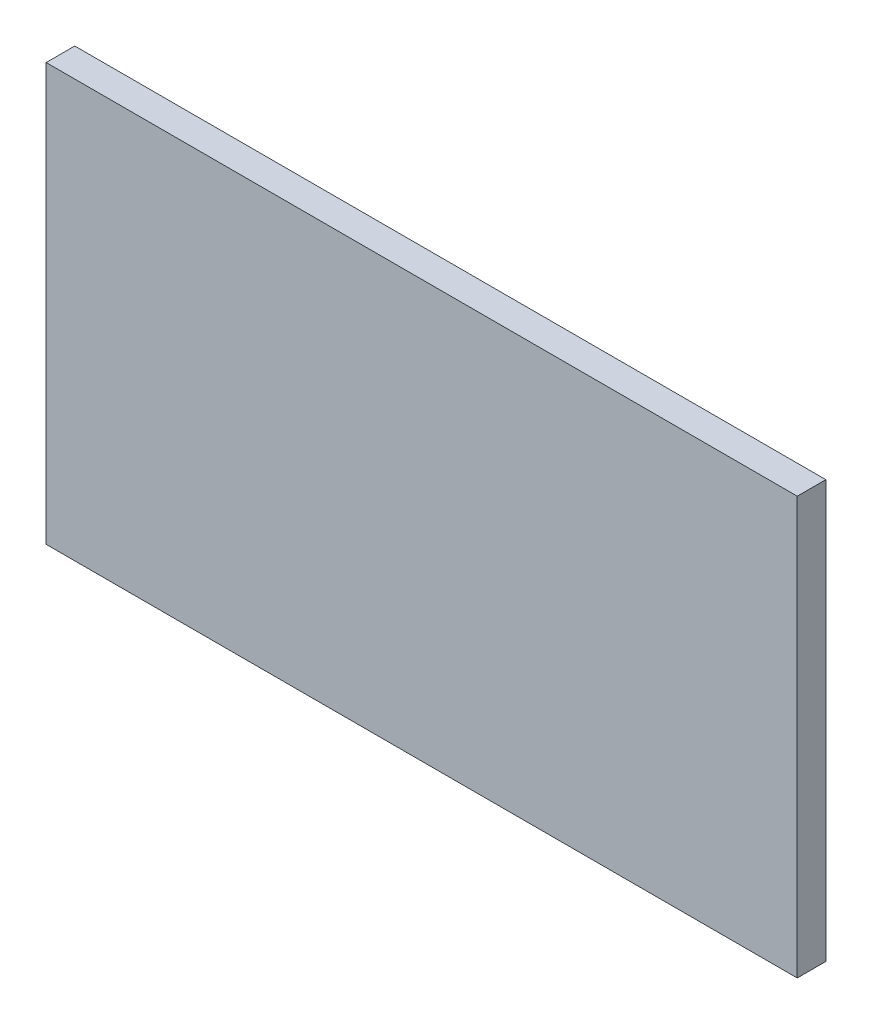
ISO-10303-21;
HEADER;
FILE_DESCRIPTION(('STEP AP214'),'2;1');
FILE_NAME('part.step','',(''),(''),'','','');
FILE_SCHEMA(('AUTOMOTIVE_DESIGN { 1 0 10303 214 1 1 1 1 }'));
ENDSEC;
DATA;
#1=APPLICATION_CONTEXT('core data for automotive mechanical design processes');
#2=APPLICATION_PROTOCOL_DEFINITION('international standard','automotive_design',2000,#1);
#3=PRODUCT_CONTEXT('',#1,'mechanical');
#4=PRODUCT('Part','Part','',(#3));
#5=PRODUCT_RELATED_PRODUCT_CATEGORY('part','',(#4));
#6=PRODUCT_DEFINITION_FORMATION('','',#4);
#7=PRODUCT_DEFINITION_CONTEXT('part definition',#1,'design');
#8=PRODUCT_DEFINITION('design','',#6,#7);
#9=PRODUCT_DEFINITION_SHAPE('','',#8);
#10=(LENGTH_UNIT() NAMED_UNIT(*) SI_UNIT(.MILLI.,.METRE.));
#11=(NAMED_UNIT(*) PLANE_ANGLE_UNIT() SI_UNIT($,.RADIAN.));
#12=(NAMED_UNIT(*) SI_UNIT($,.STERADIAN.) SOLID_ANGLE_UNIT());
#13=UNCERTAINTY_MEASURE_WITH_UNIT(LENGTH_MEASURE(1.E-05),#10,'distance_accuracy_value','');
#14=(GEOMETRIC_REPRESENTATION_CONTEXT(3) GLOBAL_UNCERTAINTY_ASSIGNED_CONTEXT((#13)) GLOBAL_UNIT_ASSIGNED_CONTEXT((#10,
#11,#12)) REPRESENTATION_CONTEXT('',''));
#15=CARTESIAN_POINT('',(0.,0.,0.));
#16=DIRECTION('',(0.,0.,1.));
#17=DIRECTION('',(1.,0.,0.));
#18=AXIS2_PLACEMENT_3D('',#15,#16,#17);
#19=CARTESIAN_POINT('',(12.50008,2.4,0.));
#20=DIRECTION('',(0.,0.,-1.));
#21=DIRECTION('',(-1.,0.,0.));
#22=AXIS2_PLACEMENT_3D('',#19,#20,#21);
#23=PLANE('',#22);
#24=DIRECTION('',(1.,0.,0.));
#25=VECTOR('',#24,1.);
#26=CARTESIAN_POINT('',(12.05008,2.65,0.));
#27=LINE('',#26,#25);
#28=CARTESIAN_POINT('',(12.05008,2.65,0.));
#29=VERTEX_POINT('',#28);
#30=CARTESIAN_POINT('',(12.95008,2.65,0.));
#31=VERTEX_POINT('',#30);
#32=EDGE_CURVE('E55',#29,#31,#27,.T.);
#33=ORIENTED_EDGE('',*,*,#32,.T.);
#34=DIRECTION('',(0.,1.,0.));
#35=VECTOR('',#34,1.);
#36=CARTESIAN_POINT('',(12.95008,2.65,0.));
#37=LINE('',#36,#35);
#38=CARTESIAN_POINT('',(12.95008,2.15,0.));
#39=VERTEX_POINT('',#38);
#40=EDGE_CURVE('E57',#31,#39,#37,.F.);
#41=ORIENTED_EDGE('',*,*,#40,.T.);
#42=DIRECTION('',(1.,0.,0.));
#43=VECTOR('',#42,1.);
#44=CARTESIAN_POINT('',(12.95008,2.15,0.));
#45=LINE('',#44,#43);
#46=CARTESIAN_POINT('',(12.05008,2.15,0.));
#47=VERTEX_POINT('',#46);
#48=EDGE_CURVE('E20',#39,#47,#45,.F.);
#49=ORIENTED_EDGE('',*,*,#48,.T.);
#50=DIRECTION('',(0.,1.,0.));
#51=VECTOR('',#50,1.);
#52=CARTESIAN_POINT('',(12.05008,2.15,0.));
#53=LINE('',#52,#51);
#54=EDGE_CURVE('E80',#47,#29,#53,.T.);
#55=ORIENTED_EDGE('',*,*,#54,.T.);
#56=EDGE_LOOP('',(#33,#41,#49,#55));
#57=FACE_BOUND('',#56,.T.);
#58=ADVANCED_FACE('F17',(#57),#23,.T.);
#59=CARTESIAN_POINT('',(12.95008,2.15,0.));
#60=DIRECTION('',(0.,1.,0.));
#61=DIRECTION('',(0.,0.,1.));
#62=AXIS2_PLACEMENT_3D('',#59,#60,#61);
#63=PLANE('',#62);
#64=DIRECTION('',(0.,0.,-1.));
#65=VECTOR('',#64,1.);
#66=CARTESIAN_POINT('',(12.05008,2.15,0.));
#67=LINE('',#66,#65);
#68=CARTESIAN_POINT('',(12.05008,2.15,0.03429));
#69=VERTEX_POINT('',#68);
#70=EDGE_CURVE('E68',#69,#47,#67,.T.);
#71=ORIENTED_EDGE('',*,*,#70,.T.);
#72=ORIENTED_EDGE('',*,*,#48,.F.);
#73=DIRECTION('',(0.,0.,1.));
#74=VECTOR('',#73,1.);
#75=CARTESIAN_POINT('',(12.95008,2.15,0.));
#76=LINE('',#75,#74);
#77=CARTESIAN_POINT('',(12.95008,2.15,0.03429));
#78=VERTEX_POINT('',#77);
#79=EDGE_CURVE('E63',#39,#78,#76,.T.);
#80=ORIENTED_EDGE('',*,*,#79,.T.);
#81=DIRECTION('',(1.,0.,0.));
#82=VECTOR('',#81,1.);
#83=CARTESIAN_POINT('',(12.50008,2.15,0.03429));
#84=LINE('',#83,#82);
#85=EDGE_CURVE('E83',#69,#78,#84,.T.);
#86=ORIENTED_EDGE('',*,*,#85,.F.);
#87=EDGE_LOOP('',(#71,#72,#80,#86));
#88=FACE_BOUND('',#87,.T.);
#89=ADVANCED_FACE('F65',(#88),#63,.F.);
#90=CARTESIAN_POINT('',(12.95008,2.65,0.));
#91=DIRECTION('',(-1.,0.,0.));
#92=DIRECTION('',(0.,0.,1.));
#93=AXIS2_PLACEMENT_3D('',#90,#91,#92);
#94=PLANE('',#93);
#95=ORIENTED_EDGE('',*,*,#79,.F.);
#96=ORIENTED_EDGE('',*,*,#40,.F.);
#97=DIRECTION('',(0.,0.,-1.));
#98=VECTOR('',#97,1.);
#99=CARTESIAN_POINT('',(12.95008,2.65,0.));
#100=LINE('',#99,#98);
#101=CARTESIAN_POINT('',(12.95008,2.65,0.03429));
#102=VERTEX_POINT('',#101);
#103=EDGE_CURVE('E75',#31,#102,#100,.F.);
#104=ORIENTED_EDGE('',*,*,#103,.T.);
#105=DIRECTION('',(0.,1.,0.));
#106=VECTOR('',#105,1.);
#107=CARTESIAN_POINT('',(12.95008,2.4,0.03429));
#108=LINE('',#107,#106);
#109=EDGE_CURVE('E72',#78,#102,#108,.T.);
#110=ORIENTED_EDGE('',*,*,#109,.F.);
#111=EDGE_LOOP('',(#95,#96,#104,#110));
#112=FACE_BOUND('',#111,.T.);
#113=ADVANCED_FACE('F70',(#112),#94,.F.);
#114=CARTESIAN_POINT('',(12.05008,2.65,0.));
#115=DIRECTION('',(0.,-1.,0.));
#116=DIRECTION('',(0.,0.,-1.));
#117=AXIS2_PLACEMENT_3D('',#114,#115,#116);
#118=PLANE('',#117);
#119=ORIENTED_EDGE('',*,*,#103,.F.);
#120=ORIENTED_EDGE('',*,*,#32,.F.);
#121=DIRECTION('',(0.,0.,-1.));
#122=VECTOR('',#121,1.);
#123=CARTESIAN_POINT('',(12.05008,2.65,0.));
#124=LINE('',#123,#122);
#125=CARTESIAN_POINT('',(12.05008,2.65,0.03429));
#126=VERTEX_POINT('',#125);
#127=EDGE_CURVE('E35',#29,#126,#124,.F.);
#128=ORIENTED_EDGE('',*,*,#127,.T.);
#129=DIRECTION('',(1.,0.,0.));
#130=VECTOR('',#129,1.);
#131=CARTESIAN_POINT('',(12.50008,2.65,0.03429));
#132=LINE('',#131,#130);
#133=EDGE_CURVE('E26',#102,#126,#132,.F.);
#134=ORIENTED_EDGE('',*,*,#133,.F.);
#135=EDGE_LOOP('',(#119,#120,#128,#134));
#136=FACE_BOUND('',#135,.T.);
#137=ADVANCED_FACE('F89',(#136),#118,.F.);
#138=CARTESIAN_POINT('',(12.05008,2.15,0.));
#139=DIRECTION('',(1.,0.,0.));
#140=DIRECTION('',(0.,0.,-1.));
#141=AXIS2_PLACEMENT_3D('',#138,#139,#140);
#142=PLANE('',#141);
#143=ORIENTED_EDGE('',*,*,#127,.F.);
#144=ORIENTED_EDGE('',*,*,#54,.F.);
#145=ORIENTED_EDGE('',*,*,#70,.F.);
#146=DIRECTION('',(0.,1.,0.));
#147=VECTOR('',#146,1.);
#148=CARTESIAN_POINT('',(12.05008,2.4,0.03429));
#149=LINE('',#148,#147);
#150=EDGE_CURVE('E11',#126,#69,#149,.F.);
#151=ORIENTED_EDGE('',*,*,#150,.F.);
#152=EDGE_LOOP('',(#143,#144,#145,#151));
#153=FACE_BOUND('',#152,.T.);
#154=ADVANCED_FACE('F91',(#153),#142,.F.);
#155=CARTESIAN_POINT('',(12.50008,2.4,0.03429));
#156=DIRECTION('',(0.,0.,1.));
#157=DIRECTION('',(1.,0.,0.));
#158=AXIS2_PLACEMENT_3D('',#155,#156,#157);
#159=PLANE('',#158);
#160=ORIENTED_EDGE('',*,*,#133,.T.);
#161=ORIENTED_EDGE('',*,*,#150,.T.);
#162=ORIENTED_EDGE('',*,*,#85,.T.);
#163=ORIENTED_EDGE('',*,*,#109,.T.);
#164=EDGE_LOOP('',(#160,#161,#162,#163));
#165=FACE_BOUND('',#164,.T.);
#166=ADVANCED_FACE('F88',(#165),#159,.T.);
#167=CLOSED_SHELL('',(#58,#89,#113,#137,#154,#166));
#168=MANIFOLD_SOLID_BREP('B1',#167);
#169=ADVANCED_BREP_SHAPE_REPRESENTATION('',(#18,#168),#14);
#170=SHAPE_DEFINITION_REPRESENTATION(#9,#169);
ENDSEC;
END-ISO-10303-21;
